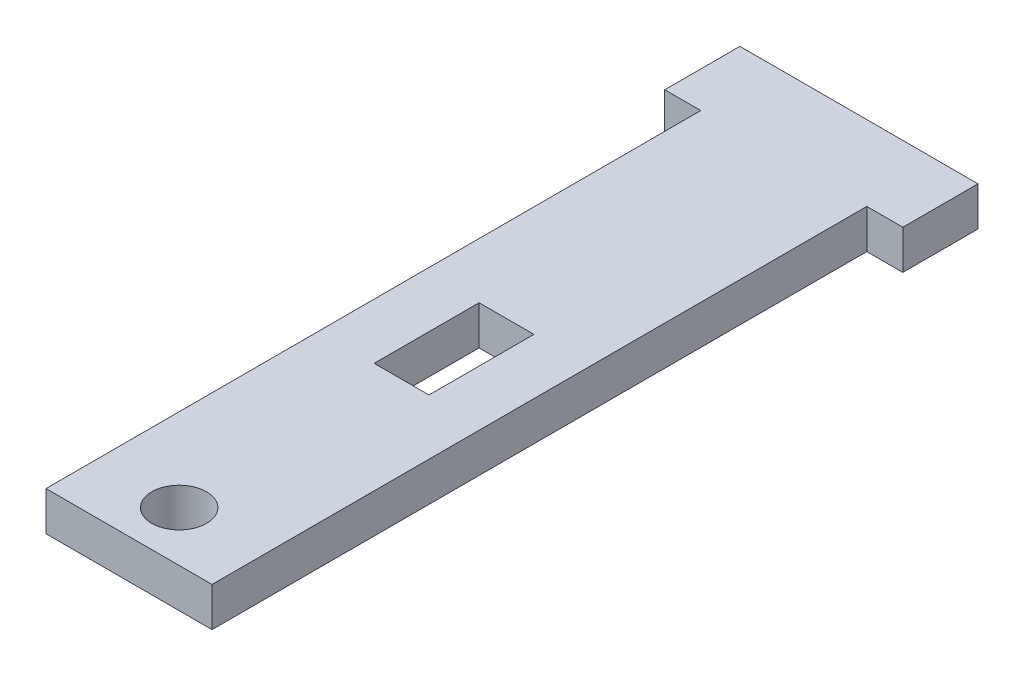
ISO-10303-21;
HEADER;
FILE_DESCRIPTION(('STEP AP214'),'2;1');
FILE_NAME('part.step','',(''),(''),'','','');
FILE_SCHEMA(('AUTOMOTIVE_DESIGN { 1 0 10303 214 1 1 1 1 }'));
ENDSEC;
DATA;
#1=APPLICATION_CONTEXT('core data for automotive mechanical design processes');
#2=APPLICATION_PROTOCOL_DEFINITION('international standard','automotive_design',2000,#1);
#3=PRODUCT_CONTEXT('',#1,'mechanical');
#4=PRODUCT('Part','Part','',(#3));
#5=PRODUCT_RELATED_PRODUCT_CATEGORY('part','',(#4));
#6=PRODUCT_DEFINITION_FORMATION('','',#4);
#7=PRODUCT_DEFINITION_CONTEXT('part definition',#1,'design');
#8=PRODUCT_DEFINITION('design','',#6,#7);
#9=PRODUCT_DEFINITION_SHAPE('','',#8);
#10=(LENGTH_UNIT() NAMED_UNIT(*) SI_UNIT(.MILLI.,.METRE.));
#11=(NAMED_UNIT(*) PLANE_ANGLE_UNIT() SI_UNIT($,.RADIAN.));
#12=(NAMED_UNIT(*) SI_UNIT($,.STERADIAN.) SOLID_ANGLE_UNIT());
#13=UNCERTAINTY_MEASURE_WITH_UNIT(LENGTH_MEASURE(1.E-05),#10,'distance_accuracy_value','');
#14=(GEOMETRIC_REPRESENTATION_CONTEXT(3) GLOBAL_UNCERTAINTY_ASSIGNED_CONTEXT((#13)) GLOBAL_UNIT_ASSIGNED_CONTEXT((#10,
#11,#12)) REPRESENTATION_CONTEXT('',''));
#15=CARTESIAN_POINT('',(0.,0.,0.));
#16=DIRECTION('',(0.,0.,1.));
#17=DIRECTION('',(1.,0.,0.));
#18=AXIS2_PLACEMENT_3D('',#15,#16,#17);
#19=CARTESIAN_POINT('',(0.,2.5,0.));
#20=DIRECTION('',(0.,-1.,0.));
#21=DIRECTION('',(0.,0.,-1.));
#22=AXIS2_PLACEMENT_3D('',#19,#20,#21);
#23=PLANE('',#22);
#24=CARTESIAN_POINT('',(0.,2.5,-3.2));
#25=DIRECTION('',(0.,1.,0.));
#26=DIRECTION('',(0.,0.,1.));
#27=AXIS2_PLACEMENT_3D('',#24,#25,#26);
#28=CIRCLE('',#27,1.75);
#29=CARTESIAN_POINT('',(0.,2.5,-1.45));
#30=VERTEX_POINT('',#29);
#31=EDGE_CURVE('E159',#30,#30,#28,.T.);
#32=ORIENTED_EDGE('',*,*,#31,.F.);
#33=EDGE_LOOP('',(#32));
#34=FACE_BOUND('',#33,.T.);
#35=DIRECTION('',(0.,0.,-1.));
#36=VECTOR('',#35,1.);
#37=CARTESIAN_POINT('',(7.6,2.5,-41.8));
#38=LINE('',#37,#36);
#39=CARTESIAN_POINT('',(7.6,2.5,-41.8));
#40=VERTEX_POINT('',#39);
#41=CARTESIAN_POINT('',(7.6,2.5,-46.6));
#42=VERTEX_POINT('',#41);
#43=EDGE_CURVE('E165',#40,#42,#38,.T.);
#44=ORIENTED_EDGE('',*,*,#43,.T.);
#45=DIRECTION('',(-1.,0.,0.));
#46=VECTOR('',#45,1.);
#47=CARTESIAN_POINT('',(-7.6,2.5,-46.6));
#48=LINE('',#47,#46);
#49=CARTESIAN_POINT('',(-7.6,2.5,-46.6));
#50=VERTEX_POINT('',#49);
#51=EDGE_CURVE('E168',#42,#50,#48,.T.);
#52=ORIENTED_EDGE('',*,*,#51,.T.);
#53=DIRECTION('',(0.,0.,1.));
#54=VECTOR('',#53,1.);
#55=CARTESIAN_POINT('',(-7.6,2.5,-41.8));
#56=LINE('',#55,#54);
#57=CARTESIAN_POINT('',(-7.6,2.5,-41.8));
#58=VERTEX_POINT('',#57);
#59=EDGE_CURVE('E171',#50,#58,#56,.T.);
#60=ORIENTED_EDGE('',*,*,#59,.T.);
#61=DIRECTION('',(1.,0.,0.));
#62=VECTOR('',#61,1.);
#63=CARTESIAN_POINT('',(-5.3,2.5,-41.8));
#64=LINE('',#63,#62);
#65=CARTESIAN_POINT('',(-5.3,2.5,-41.8));
#66=VERTEX_POINT('',#65);
#67=EDGE_CURVE('E173',#58,#66,#64,.T.);
#68=ORIENTED_EDGE('',*,*,#67,.T.);
#69=DIRECTION('',(0.,0.,1.));
#70=VECTOR('',#69,1.);
#71=CARTESIAN_POINT('',(-5.3,2.5,0.));
#72=LINE('',#71,#70);
#73=CARTESIAN_POINT('',(-5.3,2.5,0.));
#74=VERTEX_POINT('',#73);
#75=EDGE_CURVE('E175',#66,#74,#72,.T.);
#76=ORIENTED_EDGE('',*,*,#75,.T.);
#77=DIRECTION('',(1.,0.,0.));
#78=VECTOR('',#77,1.);
#79=CARTESIAN_POINT('',(5.3,2.5,0.));
#80=LINE('',#79,#78);
#81=CARTESIAN_POINT('',(5.3,2.5,0.));
#82=VERTEX_POINT('',#81);
#83=EDGE_CURVE('E177',#74,#82,#80,.T.);
#84=ORIENTED_EDGE('',*,*,#83,.T.);
#85=DIRECTION('',(0.,0.,-1.));
#86=VECTOR('',#85,1.);
#87=CARTESIAN_POINT('',(5.3,2.5,0.));
#88=LINE('',#87,#86);
#89=CARTESIAN_POINT('',(5.3,2.5,-41.8));
#90=VERTEX_POINT('',#89);
#91=EDGE_CURVE('E179',#82,#90,#88,.T.);
#92=ORIENTED_EDGE('',*,*,#91,.T.);
#93=DIRECTION('',(1.,0.,0.));
#94=VECTOR('',#93,1.);
#95=CARTESIAN_POINT('',(5.3,2.5,-41.8));
#96=LINE('',#95,#94);
#97=EDGE_CURVE('E181',#90,#40,#96,.T.);
#98=ORIENTED_EDGE('',*,*,#97,.T.);
#99=EDGE_LOOP('',(#44,#52,#60,#68,#76,#84,#92,#98));
#100=FACE_BOUND('',#99,.T.);
#101=DIRECTION('',(0.,0.,-1.));
#102=VECTOR('',#101,1.);
#103=CARTESIAN_POINT('',(1.74999999999999,2.5,-24.1));
#104=LINE('',#103,#102);
#105=CARTESIAN_POINT('',(1.74999999999999,2.5,-17.4));
#106=VERTEX_POINT('',#105);
#107=CARTESIAN_POINT('',(1.74999999999999,2.5,-24.1));
#108=VERTEX_POINT('',#107);
#109=EDGE_CURVE('E123',#106,#108,#104,.T.);
#110=ORIENTED_EDGE('',*,*,#109,.F.);
#111=DIRECTION('',(1.,0.,0.));
#112=VECTOR('',#111,1.);
#113=CARTESIAN_POINT('',(-1.75000000000001,2.5,-17.4));
#114=LINE('',#113,#112);
#115=CARTESIAN_POINT('',(-1.75000000000001,2.5,-17.4));
#116=VERTEX_POINT('',#115);
#117=EDGE_CURVE('E145',#116,#106,#114,.T.);
#118=ORIENTED_EDGE('',*,*,#117,.F.);
#119=DIRECTION('',(0.,0.,1.));
#120=VECTOR('',#119,1.);
#121=CARTESIAN_POINT('',(-1.75000000000001,2.5,-24.1));
#122=LINE('',#121,#120);
#123=CARTESIAN_POINT('',(-1.75000000000001,2.5,-24.1));
#124=VERTEX_POINT('',#123);
#125=EDGE_CURVE('E143',#124,#116,#122,.T.);
#126=ORIENTED_EDGE('',*,*,#125,.F.);
#127=DIRECTION('',(-1.,0.,0.));
#128=VECTOR('',#127,1.);
#129=CARTESIAN_POINT('',(-1.75000000000001,2.5,-24.1));
#130=LINE('',#129,#128);
#131=EDGE_CURVE('E131',#108,#124,#130,.T.);
#132=ORIENTED_EDGE('',*,*,#131,.F.);
#133=EDGE_LOOP('',(#110,#118,#126,#132));
#134=FACE_BOUND('',#133,.T.);
#135=ADVANCED_FACE('F34',(#34,#100,#134),#23,.F.);
#136=CARTESIAN_POINT('',(0.,0.,0.));
#137=DIRECTION('',(0.,-1.,0.));
#138=DIRECTION('',(0.,0.,-1.));
#139=AXIS2_PLACEMENT_3D('',#136,#137,#138);
#140=PLANE('',#139);
#141=CARTESIAN_POINT('',(0.,0.,-3.2));
#142=DIRECTION('',(0.,1.,0.));
#143=DIRECTION('',(0.,0.,1.));
#144=AXIS2_PLACEMENT_3D('',#141,#142,#143);
#145=CIRCLE('',#144,1.75);
#146=CARTESIAN_POINT('',(0.,0.,-1.45));
#147=VERTEX_POINT('',#146);
#148=EDGE_CURVE('E139',#147,#147,#145,.T.);
#149=ORIENTED_EDGE('',*,*,#148,.T.);
#150=EDGE_LOOP('',(#149));
#151=FACE_BOUND('',#150,.T.);
#152=DIRECTION('',(0.,0.,-1.));
#153=VECTOR('',#152,1.);
#154=CARTESIAN_POINT('',(7.6,0.,-41.8));
#155=LINE('',#154,#153);
#156=CARTESIAN_POINT('',(7.6,0.,-41.8));
#157=VERTEX_POINT('',#156);
#158=CARTESIAN_POINT('',(7.6,0.,-46.6));
#159=VERTEX_POINT('',#158);
#160=EDGE_CURVE('E162',#157,#159,#155,.T.);
#161=ORIENTED_EDGE('',*,*,#160,.F.);
#162=DIRECTION('',(1.,0.,0.));
#163=VECTOR('',#162,1.);
#164=CARTESIAN_POINT('',(5.3,0.,-41.8));
#165=LINE('',#164,#163);
#166=CARTESIAN_POINT('',(5.3,0.,-41.8));
#167=VERTEX_POINT('',#166);
#168=EDGE_CURVE('E169',#167,#157,#165,.T.);
#169=ORIENTED_EDGE('',*,*,#168,.F.);
#170=DIRECTION('',(0.,0.,-1.));
#171=VECTOR('',#170,1.);
#172=CARTESIAN_POINT('',(5.3,0.,0.));
#173=LINE('',#172,#171);
#174=CARTESIAN_POINT('',(5.3,0.,0.));
#175=VERTEX_POINT('',#174);
#176=EDGE_CURVE('E196',#175,#167,#173,.T.);
#177=ORIENTED_EDGE('',*,*,#176,.F.);
#178=DIRECTION('',(1.,0.,0.));
#179=VECTOR('',#178,1.);
#180=CARTESIAN_POINT('',(5.3,0.,0.));
#181=LINE('',#180,#179);
#182=CARTESIAN_POINT('',(-5.3,0.,0.));
#183=VERTEX_POINT('',#182);
#184=EDGE_CURVE('E194',#183,#175,#181,.T.);
#185=ORIENTED_EDGE('',*,*,#184,.F.);
#186=DIRECTION('',(0.,0.,1.));
#187=VECTOR('',#186,1.);
#188=CARTESIAN_POINT('',(-5.3,0.,0.));
#189=LINE('',#188,#187);
#190=CARTESIAN_POINT('',(-5.3,0.,-41.8));
#191=VERTEX_POINT('',#190);
#192=EDGE_CURVE('E192',#191,#183,#189,.T.);
#193=ORIENTED_EDGE('',*,*,#192,.F.);
#194=DIRECTION('',(1.,0.,0.));
#195=VECTOR('',#194,1.);
#196=CARTESIAN_POINT('',(-5.3,0.,-41.8));
#197=LINE('',#196,#195);
#198=CARTESIAN_POINT('',(-7.6,0.,-41.8));
#199=VERTEX_POINT('',#198);
#200=EDGE_CURVE('E190',#199,#191,#197,.T.);
#201=ORIENTED_EDGE('',*,*,#200,.F.);
#202=DIRECTION('',(0.,0.,1.));
#203=VECTOR('',#202,1.);
#204=CARTESIAN_POINT('',(-7.6,0.,-41.8));
#205=LINE('',#204,#203);
#206=CARTESIAN_POINT('',(-7.6,0.,-46.6));
#207=VERTEX_POINT('',#206);
#208=EDGE_CURVE('E188',#207,#199,#205,.T.);
#209=ORIENTED_EDGE('',*,*,#208,.F.);
#210=DIRECTION('',(-1.,0.,0.));
#211=VECTOR('',#210,1.);
#212=CARTESIAN_POINT('',(-7.6,0.,-46.6));
#213=LINE('',#212,#211);
#214=EDGE_CURVE('E186',#159,#207,#213,.T.);
#215=ORIENTED_EDGE('',*,*,#214,.F.);
#216=EDGE_LOOP('',(#161,#169,#177,#185,#193,#201,#209,#215));
#217=FACE_BOUND('',#216,.T.);
#218=DIRECTION('',(1.,0.,0.));
#219=VECTOR('',#218,1.);
#220=CARTESIAN_POINT('',(-1.75000000000001,0.,-17.4));
#221=LINE('',#220,#219);
#222=CARTESIAN_POINT('',(-1.75000000000001,0.,-17.4));
#223=VERTEX_POINT('',#222);
#224=CARTESIAN_POINT('',(1.74999999999999,0.,-17.4));
#225=VERTEX_POINT('',#224);
#226=EDGE_CURVE('E132',#223,#225,#221,.T.);
#227=ORIENTED_EDGE('',*,*,#226,.T.);
#228=DIRECTION('',(0.,0.,-1.));
#229=VECTOR('',#228,1.);
#230=CARTESIAN_POINT('',(1.74999999999999,0.,-24.1));
#231=LINE('',#230,#229);
#232=CARTESIAN_POINT('',(1.74999999999999,0.,-24.1));
#233=VERTEX_POINT('',#232);
#234=EDGE_CURVE('E57',#225,#233,#231,.T.);
#235=ORIENTED_EDGE('',*,*,#234,.T.);
#236=DIRECTION('',(-1.,0.,0.));
#237=VECTOR('',#236,1.);
#238=CARTESIAN_POINT('',(-1.75000000000001,0.,-24.1));
#239=LINE('',#238,#237);
#240=CARTESIAN_POINT('',(-1.75000000000001,0.,-24.1));
#241=VERTEX_POINT('',#240);
#242=EDGE_CURVE('E138',#233,#241,#239,.T.);
#243=ORIENTED_EDGE('',*,*,#242,.T.);
#244=DIRECTION('',(0.,0.,1.));
#245=VECTOR('',#244,1.);
#246=CARTESIAN_POINT('',(-1.75000000000001,0.,-24.1));
#247=LINE('',#246,#245);
#248=EDGE_CURVE('E151',#241,#223,#247,.T.);
#249=ORIENTED_EDGE('',*,*,#248,.T.);
#250=EDGE_LOOP('',(#227,#235,#243,#249));
#251=FACE_BOUND('',#250,.T.);
#252=ADVANCED_FACE('F226',(#151,#217,#251),#140,.T.);
#253=CARTESIAN_POINT('',(7.6,2.5,-41.8));
#254=DIRECTION('',(-1.,0.,0.));
#255=DIRECTION('',(0.,0.,1.));
#256=AXIS2_PLACEMENT_3D('',#253,#254,#255);
#257=PLANE('',#256);
#258=ORIENTED_EDGE('',*,*,#160,.T.);
#259=DIRECTION('',(0.,-1.,0.));
#260=VECTOR('',#259,1.);
#261=CARTESIAN_POINT('',(7.6,2.5,-46.6));
#262=LINE('',#261,#260);
#263=EDGE_CURVE('E11',#42,#159,#262,.T.);
#264=ORIENTED_EDGE('',*,*,#263,.F.);
#265=ORIENTED_EDGE('',*,*,#43,.F.);
#266=DIRECTION('',(0.,-1.,0.));
#267=VECTOR('',#266,1.);
#268=CARTESIAN_POINT('',(7.6,2.5,-41.8));
#269=LINE('',#268,#267);
#270=EDGE_CURVE('E183',#40,#157,#269,.T.);
#271=ORIENTED_EDGE('',*,*,#270,.T.);
#272=EDGE_LOOP('',(#258,#264,#265,#271));
#273=FACE_BOUND('',#272,.T.);
#274=ADVANCED_FACE('F36',(#273),#257,.F.);
#275=CARTESIAN_POINT('',(-7.6,2.5,-46.6));
#276=DIRECTION('',(0.,0.,1.));
#277=DIRECTION('',(1.,0.,0.));
#278=AXIS2_PLACEMENT_3D('',#275,#276,#277);
#279=PLANE('',#278);
#280=ORIENTED_EDGE('',*,*,#214,.T.);
#281=DIRECTION('',(0.,-1.,0.));
#282=VECTOR('',#281,1.);
#283=CARTESIAN_POINT('',(-7.6,2.5,-46.6));
#284=LINE('',#283,#282);
#285=EDGE_CURVE('E42',#50,#207,#284,.T.);
#286=ORIENTED_EDGE('',*,*,#285,.F.);
#287=ORIENTED_EDGE('',*,*,#51,.F.);
#288=ORIENTED_EDGE('',*,*,#263,.T.);
#289=EDGE_LOOP('',(#280,#286,#287,#288));
#290=FACE_BOUND('',#289,.T.);
#291=ADVANCED_FACE('F243',(#290),#279,.F.);
#292=CARTESIAN_POINT('',(-7.6,2.5,-41.8));
#293=DIRECTION('',(1.,0.,0.));
#294=DIRECTION('',(0.,0.,-1.));
#295=AXIS2_PLACEMENT_3D('',#292,#293,#294);
#296=PLANE('',#295);
#297=ORIENTED_EDGE('',*,*,#208,.T.);
#298=DIRECTION('',(0.,-1.,0.));
#299=VECTOR('',#298,1.);
#300=CARTESIAN_POINT('',(-7.6,2.5,-41.8));
#301=LINE('',#300,#299);
#302=EDGE_CURVE('E213',#58,#199,#301,.T.);
#303=ORIENTED_EDGE('',*,*,#302,.F.);
#304=ORIENTED_EDGE('',*,*,#59,.F.);
#305=ORIENTED_EDGE('',*,*,#285,.T.);
#306=EDGE_LOOP('',(#297,#303,#304,#305));
#307=FACE_BOUND('',#306,.T.);
#308=ADVANCED_FACE('F220',(#307),#296,.F.);
#309=CARTESIAN_POINT('',(-5.3,2.5,-41.8));
#310=DIRECTION('',(0.,0.,-1.));
#311=DIRECTION('',(-1.,0.,0.));
#312=AXIS2_PLACEMENT_3D('',#309,#310,#311);
#313=PLANE('',#312);
#314=ORIENTED_EDGE('',*,*,#200,.T.);
#315=DIRECTION('',(0.,-1.,0.));
#316=VECTOR('',#315,1.);
#317=CARTESIAN_POINT('',(-5.3,2.5,-41.8));
#318=LINE('',#317,#316);
#319=EDGE_CURVE('E210',#66,#191,#318,.T.);
#320=ORIENTED_EDGE('',*,*,#319,.F.);
#321=ORIENTED_EDGE('',*,*,#67,.F.);
#322=ORIENTED_EDGE('',*,*,#302,.T.);
#323=EDGE_LOOP('',(#314,#320,#321,#322));
#324=FACE_BOUND('',#323,.T.);
#325=ADVANCED_FACE('F232',(#324),#313,.F.);
#326=CARTESIAN_POINT('',(-5.3,2.5,0.));
#327=DIRECTION('',(1.,0.,0.));
#328=DIRECTION('',(0.,0.,-1.));
#329=AXIS2_PLACEMENT_3D('',#326,#327,#328);
#330=PLANE('',#329);
#331=ORIENTED_EDGE('',*,*,#192,.T.);
#332=DIRECTION('',(0.,-1.,0.));
#333=VECTOR('',#332,1.);
#334=CARTESIAN_POINT('',(-5.3,2.5,0.));
#335=LINE('',#334,#333);
#336=EDGE_CURVE('E207',#74,#183,#335,.T.);
#337=ORIENTED_EDGE('',*,*,#336,.F.);
#338=ORIENTED_EDGE('',*,*,#75,.F.);
#339=ORIENTED_EDGE('',*,*,#319,.T.);
#340=EDGE_LOOP('',(#331,#337,#338,#339));
#341=FACE_BOUND('',#340,.T.);
#342=ADVANCED_FACE('F236',(#341),#330,.F.);
#343=CARTESIAN_POINT('',(5.3,2.5,0.));
#344=DIRECTION('',(0.,0.,-1.));
#345=DIRECTION('',(-1.,0.,0.));
#346=AXIS2_PLACEMENT_3D('',#343,#344,#345);
#347=PLANE('',#346);
#348=ORIENTED_EDGE('',*,*,#184,.T.);
#349=DIRECTION('',(0.,-1.,0.));
#350=VECTOR('',#349,1.);
#351=CARTESIAN_POINT('',(5.3,2.5,0.));
#352=LINE('',#351,#350);
#353=EDGE_CURVE('E204',#82,#175,#352,.T.);
#354=ORIENTED_EDGE('',*,*,#353,.F.);
#355=ORIENTED_EDGE('',*,*,#83,.F.);
#356=ORIENTED_EDGE('',*,*,#336,.T.);
#357=EDGE_LOOP('',(#348,#354,#355,#356));
#358=FACE_BOUND('',#357,.T.);
#359=ADVANCED_FACE('F256',(#358),#347,.F.);
#360=CARTESIAN_POINT('',(5.3,2.5,0.));
#361=DIRECTION('',(-1.,0.,0.));
#362=DIRECTION('',(0.,0.,1.));
#363=AXIS2_PLACEMENT_3D('',#360,#361,#362);
#364=PLANE('',#363);
#365=ORIENTED_EDGE('',*,*,#176,.T.);
#366=DIRECTION('',(0.,-1.,0.));
#367=VECTOR('',#366,1.);
#368=CARTESIAN_POINT('',(5.3,2.5,-41.8));
#369=LINE('',#368,#367);
#370=EDGE_CURVE('E201',#90,#167,#369,.T.);
#371=ORIENTED_EDGE('',*,*,#370,.F.);
#372=ORIENTED_EDGE('',*,*,#91,.F.);
#373=ORIENTED_EDGE('',*,*,#353,.T.);
#374=EDGE_LOOP('',(#365,#371,#372,#373));
#375=FACE_BOUND('',#374,.T.);
#376=ADVANCED_FACE('F254',(#375),#364,.F.);
#377=CARTESIAN_POINT('',(5.3,2.5,-41.8));
#378=DIRECTION('',(0.,0.,-1.));
#379=DIRECTION('',(-1.,0.,0.));
#380=AXIS2_PLACEMENT_3D('',#377,#378,#379);
#381=PLANE('',#380);
#382=ORIENTED_EDGE('',*,*,#168,.T.);
#383=ORIENTED_EDGE('',*,*,#270,.F.);
#384=ORIENTED_EDGE('',*,*,#97,.F.);
#385=ORIENTED_EDGE('',*,*,#370,.T.);
#386=EDGE_LOOP('',(#382,#383,#384,#385));
#387=FACE_BOUND('',#386,.T.);
#388=ADVANCED_FACE('F249',(#387),#381,.F.);
#389=CARTESIAN_POINT('',(0.,2.5,-3.2));
#390=DIRECTION('',(0.,-1.,0.));
#391=DIRECTION('',(0.,0.,-1.));
#392=AXIS2_PLACEMENT_3D('',#389,#390,#391);
#393=CYLINDRICAL_SURFACE('',#392,1.75);
#394=ORIENTED_EDGE('',*,*,#31,.T.);
#395=EDGE_LOOP('',(#394));
#396=FACE_BOUND('',#395,.T.);
#397=ORIENTED_EDGE('',*,*,#148,.F.);
#398=EDGE_LOOP('',(#397));
#399=FACE_BOUND('',#398,.T.);
#400=ADVANCED_FACE('F275',(#396,#399),#393,.F.);
#401=CARTESIAN_POINT('',(1.74999999999999,2.5,-24.1));
#402=DIRECTION('',(-1.,0.,0.));
#403=DIRECTION('',(0.,0.,1.));
#404=AXIS2_PLACEMENT_3D('',#401,#402,#403);
#405=PLANE('',#404);
#406=ORIENTED_EDGE('',*,*,#234,.F.);
#407=DIRECTION('',(0.,-1.,0.));
#408=VECTOR('',#407,1.);
#409=CARTESIAN_POINT('',(1.74999999999999,2.5,-17.4));
#410=LINE('',#409,#408);
#411=EDGE_CURVE('E127',#106,#225,#410,.T.);
#412=ORIENTED_EDGE('',*,*,#411,.F.);
#413=ORIENTED_EDGE('',*,*,#109,.T.);
#414=DIRECTION('',(0.,-1.,0.));
#415=VECTOR('',#414,1.);
#416=CARTESIAN_POINT('',(1.74999999999999,2.5,-24.1));
#417=LINE('',#416,#415);
#418=EDGE_CURVE('E126',#108,#233,#417,.T.);
#419=ORIENTED_EDGE('',*,*,#418,.T.);
#420=EDGE_LOOP('',(#406,#412,#413,#419));
#421=FACE_BOUND('',#420,.T.);
#422=ADVANCED_FACE('F125',(#421),#405,.T.);
#423=CARTESIAN_POINT('',(-1.75000000000001,2.5,-24.1));
#424=DIRECTION('',(0.,0.,1.));
#425=DIRECTION('',(1.,0.,0.));
#426=AXIS2_PLACEMENT_3D('',#423,#424,#425);
#427=PLANE('',#426);
#428=ORIENTED_EDGE('',*,*,#242,.F.);
#429=ORIENTED_EDGE('',*,*,#418,.F.);
#430=ORIENTED_EDGE('',*,*,#131,.T.);
#431=DIRECTION('',(0.,-1.,0.));
#432=VECTOR('',#431,1.);
#433=CARTESIAN_POINT('',(-1.75000000000001,2.5,-24.1));
#434=LINE('',#433,#432);
#435=EDGE_CURVE('E140',#124,#241,#434,.T.);
#436=ORIENTED_EDGE('',*,*,#435,.T.);
#437=EDGE_LOOP('',(#428,#429,#430,#436));
#438=FACE_BOUND('',#437,.T.);
#439=ADVANCED_FACE('F135',(#438),#427,.T.);
#440=CARTESIAN_POINT('',(-1.75000000000001,2.5,-24.1));
#441=DIRECTION('',(1.,0.,0.));
#442=DIRECTION('',(0.,0.,-1.));
#443=AXIS2_PLACEMENT_3D('',#440,#441,#442);
#444=PLANE('',#443);
#445=ORIENTED_EDGE('',*,*,#248,.F.);
#446=ORIENTED_EDGE('',*,*,#435,.F.);
#447=ORIENTED_EDGE('',*,*,#125,.T.);
#448=DIRECTION('',(0.,-1.,0.));
#449=VECTOR('',#448,1.);
#450=CARTESIAN_POINT('',(-1.75000000000001,2.5,-17.4));
#451=LINE('',#450,#449);
#452=EDGE_CURVE('E49',#116,#223,#451,.T.);
#453=ORIENTED_EDGE('',*,*,#452,.T.);
#454=EDGE_LOOP('',(#445,#446,#447,#453));
#455=FACE_BOUND('',#454,.T.);
#456=ADVANCED_FACE('F291',(#455),#444,.T.);
#457=CARTESIAN_POINT('',(-1.75000000000001,2.5,-17.4));
#458=DIRECTION('',(0.,0.,-1.));
#459=DIRECTION('',(-1.,0.,0.));
#460=AXIS2_PLACEMENT_3D('',#457,#458,#459);
#461=PLANE('',#460);
#462=ORIENTED_EDGE('',*,*,#226,.F.);
#463=ORIENTED_EDGE('',*,*,#452,.F.);
#464=ORIENTED_EDGE('',*,*,#117,.T.);
#465=ORIENTED_EDGE('',*,*,#411,.T.);
#466=EDGE_LOOP('',(#462,#463,#464,#465));
#467=FACE_BOUND('',#466,.T.);
#468=ADVANCED_FACE('F296',(#467),#461,.T.);
#469=CLOSED_SHELL('',(#135,#252,#274,#291,#308,#325,#342,#359,#376,#388,#400,#422,#439,#456,#468));
#470=MANIFOLD_SOLID_BREP('B2',#469);
#471=ADVANCED_BREP_SHAPE_REPRESENTATION('',(#18,#470),#14);
#472=SHAPE_DEFINITION_REPRESENTATION(#9,#471);
ENDSEC;
END-ISO-10303-21;
